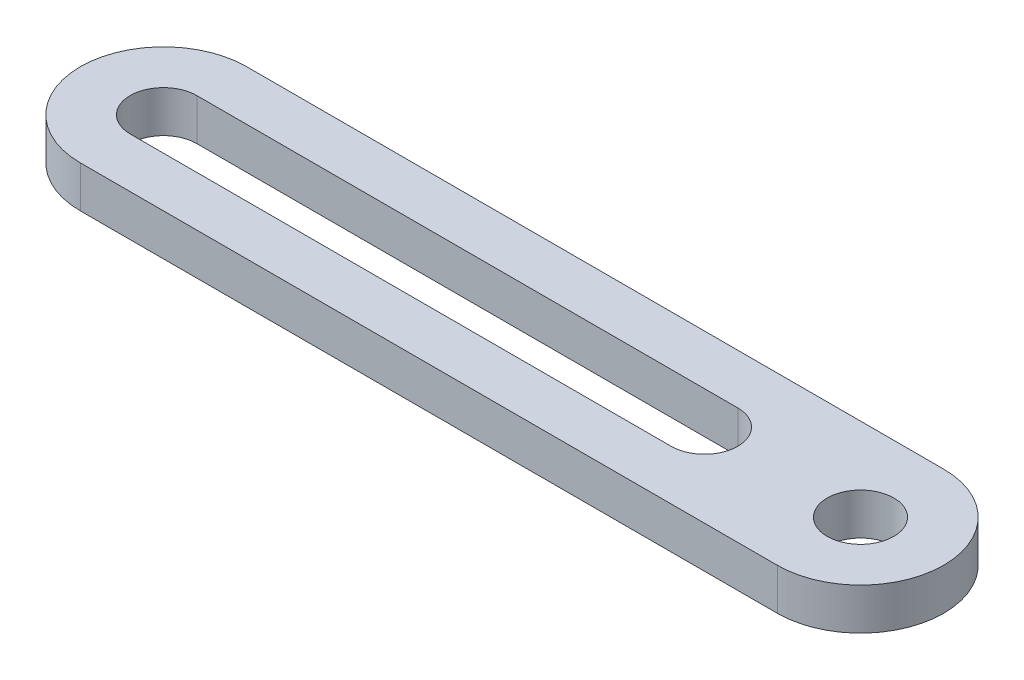
ISO-10303-21;
HEADER;
FILE_DESCRIPTION(('STEP AP214'),'2;1');
FILE_NAME('part.step','',(''),(''),'','','');
FILE_SCHEMA(('AUTOMOTIVE_DESIGN { 1 0 10303 214 1 1 1 1 }'));
ENDSEC;
DATA;
#1=APPLICATION_CONTEXT('core data for automotive mechanical design processes');
#2=APPLICATION_PROTOCOL_DEFINITION('international standard','automotive_design',2000,#1);
#3=PRODUCT_CONTEXT('',#1,'mechanical');
#4=PRODUCT('Part','Part','',(#3));
#5=PRODUCT_RELATED_PRODUCT_CATEGORY('part','',(#4));
#6=PRODUCT_DEFINITION_FORMATION('','',#4);
#7=PRODUCT_DEFINITION_CONTEXT('part definition',#1,'design');
#8=PRODUCT_DEFINITION('design','',#6,#7);
#9=PRODUCT_DEFINITION_SHAPE('','',#8);
#10=(LENGTH_UNIT() NAMED_UNIT(*) SI_UNIT(.MILLI.,.METRE.));
#11=(NAMED_UNIT(*) PLANE_ANGLE_UNIT() SI_UNIT($,.RADIAN.));
#12=(NAMED_UNIT(*) SI_UNIT($,.STERADIAN.) SOLID_ANGLE_UNIT());
#13=UNCERTAINTY_MEASURE_WITH_UNIT(LENGTH_MEASURE(1.E-05),#10,'distance_accuracy_value','');
#14=(GEOMETRIC_REPRESENTATION_CONTEXT(3) GLOBAL_UNCERTAINTY_ASSIGNED_CONTEXT((#13)) GLOBAL_UNIT_ASSIGNED_CONTEXT((#10,
#11,#12)) REPRESENTATION_CONTEXT('',''));
#15=CARTESIAN_POINT('',(0.,0.,0.));
#16=DIRECTION('',(0.,0.,1.));
#17=DIRECTION('',(1.,0.,0.));
#18=AXIS2_PLACEMENT_3D('',#15,#16,#17);
#19=CARTESIAN_POINT('',(0.,2.,0.));
#20=DIRECTION('',(0.,1.,0.));
#21=DIRECTION('',(0.,0.,1.));
#22=AXIS2_PLACEMENT_3D('',#19,#20,#21);
#23=PLANE('',#22);
#24=DIRECTION('',(1.,0.,0.));
#25=VECTOR('',#24,1.);
#26=CARTESIAN_POINT('',(-33.5,2.,1.6));
#27=LINE('',#26,#25);
#28=CARTESIAN_POINT('',(-33.5,2.,1.6));
#29=VERTEX_POINT('',#28);
#30=CARTESIAN_POINT('',(-7.5,2.,1.6));
#31=VERTEX_POINT('',#30);
#32=EDGE_CURVE('E107',#29,#31,#27,.T.);
#33=ORIENTED_EDGE('',*,*,#32,.F.);
#34=CARTESIAN_POINT('',(-33.5,2.,0.));
#35=DIRECTION('',(0.,1.,0.));
#36=DIRECTION('',(0.,0.,1.));
#37=AXIS2_PLACEMENT_3D('',#34,#35,#36);
#38=CIRCLE('',#37,1.6);
#39=CARTESIAN_POINT('',(-33.5,2.,-1.6));
#40=VERTEX_POINT('',#39);
#41=EDGE_CURVE('E99',#40,#29,#38,.T.);
#42=ORIENTED_EDGE('',*,*,#41,.F.);
#43=DIRECTION('',(-1.,0.,0.));
#44=VECTOR('',#43,1.);
#45=CARTESIAN_POINT('',(-33.5,2.,-1.6));
#46=LINE('',#45,#44);
#47=CARTESIAN_POINT('',(-7.5,2.,-1.6));
#48=VERTEX_POINT('',#47);
#49=EDGE_CURVE('E122',#48,#40,#46,.T.);
#50=ORIENTED_EDGE('',*,*,#49,.F.);
#51=CARTESIAN_POINT('',(-7.5,2.,0.));
#52=DIRECTION('',(0.,1.,0.));
#53=DIRECTION('',(0.,0.,1.));
#54=AXIS2_PLACEMENT_3D('',#51,#52,#53);
#55=CIRCLE('',#54,1.6);
#56=EDGE_CURVE('E120',#31,#48,#55,.T.);
#57=ORIENTED_EDGE('',*,*,#56,.F.);
#58=EDGE_LOOP('',(#33,#42,#50,#57));
#59=FACE_BOUND('',#58,.T.);
#60=CARTESIAN_POINT('',(0.,2.,0.));
#61=DIRECTION('',(0.,1.,0.));
#62=DIRECTION('',(0.,0.,1.));
#63=AXIS2_PLACEMENT_3D('',#60,#61,#62);
#64=CIRCLE('',#63,4.);
#65=CARTESIAN_POINT('',(0.,2.,4.));
#66=VERTEX_POINT('',#65);
#67=CARTESIAN_POINT('',(0.,2.,-4.));
#68=VERTEX_POINT('',#67);
#69=EDGE_CURVE('E138',#66,#68,#64,.T.);
#70=ORIENTED_EDGE('',*,*,#69,.T.);
#71=DIRECTION('',(-1.,0.,0.));
#72=VECTOR('',#71,1.);
#73=CARTESIAN_POINT('',(0.,2.,-4.));
#74=LINE('',#73,#72);
#75=CARTESIAN_POINT('',(-33.5,2.,-3.99999999999999));
#76=VERTEX_POINT('',#75);
#77=EDGE_CURVE('E141',#68,#76,#74,.T.);
#78=ORIENTED_EDGE('',*,*,#77,.T.);
#79=CARTESIAN_POINT('',(-33.5,2.,0.));
#80=DIRECTION('',(0.,1.,0.));
#81=DIRECTION('',(0.,0.,1.));
#82=AXIS2_PLACEMENT_3D('',#79,#80,#81);
#83=CIRCLE('',#82,4.);
#84=CARTESIAN_POINT('',(-33.5,2.,4.));
#85=VERTEX_POINT('',#84);
#86=EDGE_CURVE('E144',#76,#85,#83,.T.);
#87=ORIENTED_EDGE('',*,*,#86,.T.);
#88=DIRECTION('',(1.,0.,0.));
#89=VECTOR('',#88,1.);
#90=CARTESIAN_POINT('',(0.,2.,4.));
#91=LINE('',#90,#89);
#92=EDGE_CURVE('E146',#85,#66,#91,.T.);
#93=ORIENTED_EDGE('',*,*,#92,.T.);
#94=EDGE_LOOP('',(#70,#78,#87,#93));
#95=FACE_BOUND('',#94,.T.);
#96=CARTESIAN_POINT('',(0.,2.,0.));
#97=DIRECTION('',(0.,1.,0.));
#98=DIRECTION('',(0.,0.,1.));
#99=AXIS2_PLACEMENT_3D('',#96,#97,#98);
#100=CIRCLE('',#99,1.6);
#101=CARTESIAN_POINT('',(0.,2.,1.6));
#102=VERTEX_POINT('',#101);
#103=EDGE_CURVE('E128',#102,#102,#100,.T.);
#104=ORIENTED_EDGE('',*,*,#103,.F.);
#105=EDGE_LOOP('',(#104));
#106=FACE_BOUND('',#105,.T.);
#107=ADVANCED_FACE('F34',(#59,#95,#106),#23,.T.);
#108=CARTESIAN_POINT('',(0.,0.,0.));
#109=DIRECTION('',(0.,1.,0.));
#110=DIRECTION('',(0.,0.,1.));
#111=AXIS2_PLACEMENT_3D('',#108,#109,#110);
#112=PLANE('',#111);
#113=CARTESIAN_POINT('',(0.,0.,0.));
#114=DIRECTION('',(0.,1.,0.));
#115=DIRECTION('',(0.,0.,1.));
#116=AXIS2_PLACEMENT_3D('',#113,#114,#115);
#117=CIRCLE('',#116,4.);
#118=CARTESIAN_POINT('',(0.,0.,4.));
#119=VERTEX_POINT('',#118);
#120=CARTESIAN_POINT('',(0.,0.,-4.));
#121=VERTEX_POINT('',#120);
#122=EDGE_CURVE('E115',#119,#121,#117,.T.);
#123=ORIENTED_EDGE('',*,*,#122,.F.);
#124=DIRECTION('',(1.,0.,0.));
#125=VECTOR('',#124,1.);
#126=CARTESIAN_POINT('',(0.,0.,4.));
#127=LINE('',#126,#125);
#128=CARTESIAN_POINT('',(-33.5,0.,4.));
#129=VERTEX_POINT('',#128);
#130=EDGE_CURVE('E142',#129,#119,#127,.T.);
#131=ORIENTED_EDGE('',*,*,#130,.F.);
#132=CARTESIAN_POINT('',(-33.5,0.,0.));
#133=DIRECTION('',(0.,1.,0.));
#134=DIRECTION('',(0.,0.,1.));
#135=AXIS2_PLACEMENT_3D('',#132,#133,#134);
#136=CIRCLE('',#135,4.);
#137=CARTESIAN_POINT('',(-33.5,0.,-3.99999999999999));
#138=VERTEX_POINT('',#137);
#139=EDGE_CURVE('E153',#138,#129,#136,.T.);
#140=ORIENTED_EDGE('',*,*,#139,.F.);
#141=DIRECTION('',(-1.,0.,0.));
#142=VECTOR('',#141,1.);
#143=CARTESIAN_POINT('',(0.,0.,-4.));
#144=LINE('',#143,#142);
#145=EDGE_CURVE('E151',#121,#138,#144,.T.);
#146=ORIENTED_EDGE('',*,*,#145,.F.);
#147=EDGE_LOOP('',(#123,#131,#140,#146));
#148=FACE_BOUND('',#147,.T.);
#149=CARTESIAN_POINT('',(-33.5,0.,0.));
#150=DIRECTION('',(0.,1.,0.));
#151=DIRECTION('',(0.,0.,1.));
#152=AXIS2_PLACEMENT_3D('',#149,#150,#151);
#153=CIRCLE('',#152,1.6);
#154=CARTESIAN_POINT('',(-33.5,0.,-1.6));
#155=VERTEX_POINT('',#154);
#156=CARTESIAN_POINT('',(-33.5,0.,1.6));
#157=VERTEX_POINT('',#156);
#158=EDGE_CURVE('E57',#155,#157,#153,.T.);
#159=ORIENTED_EDGE('',*,*,#158,.T.);
#160=DIRECTION('',(1.,0.,0.));
#161=VECTOR('',#160,1.);
#162=CARTESIAN_POINT('',(-33.5,0.,1.6));
#163=LINE('',#162,#161);
#164=CARTESIAN_POINT('',(-7.5,0.,1.6));
#165=VERTEX_POINT('',#164);
#166=EDGE_CURVE('E114',#157,#165,#163,.T.);
#167=ORIENTED_EDGE('',*,*,#166,.T.);
#168=CARTESIAN_POINT('',(-7.5,0.,0.));
#169=DIRECTION('',(0.,1.,0.));
#170=DIRECTION('',(0.,0.,1.));
#171=AXIS2_PLACEMENT_3D('',#168,#169,#170);
#172=CIRCLE('',#171,1.6);
#173=CARTESIAN_POINT('',(-7.5,0.,-1.6));
#174=VERTEX_POINT('',#173);
#175=EDGE_CURVE('E130',#165,#174,#172,.T.);
#176=ORIENTED_EDGE('',*,*,#175,.T.);
#177=DIRECTION('',(-1.,0.,0.));
#178=VECTOR('',#177,1.);
#179=CARTESIAN_POINT('',(-33.5,0.,-1.6));
#180=LINE('',#179,#178);
#181=EDGE_CURVE('E108',#174,#155,#180,.T.);
#182=ORIENTED_EDGE('',*,*,#181,.T.);
#183=EDGE_LOOP('',(#159,#167,#176,#182));
#184=FACE_BOUND('',#183,.T.);
#185=CARTESIAN_POINT('',(0.,0.,0.));
#186=DIRECTION('',(0.,1.,0.));
#187=DIRECTION('',(0.,0.,1.));
#188=AXIS2_PLACEMENT_3D('',#185,#186,#187);
#189=CIRCLE('',#188,1.6);
#190=CARTESIAN_POINT('',(0.,0.,1.6));
#191=VERTEX_POINT('',#190);
#192=EDGE_CURVE('E224',#191,#191,#189,.T.);
#193=ORIENTED_EDGE('',*,*,#192,.T.);
#194=EDGE_LOOP('',(#193));
#195=FACE_BOUND('',#194,.T.);
#196=ADVANCED_FACE('F171',(#148,#184,#195),#112,.F.);
#197=CARTESIAN_POINT('',(0.,2.,0.));
#198=DIRECTION('',(0.,-1.,0.));
#199=DIRECTION('',(0.,0.,-1.));
#200=AXIS2_PLACEMENT_3D('',#197,#198,#199);
#201=CYLINDRICAL_SURFACE('',#200,4.);
#202=ORIENTED_EDGE('',*,*,#122,.T.);
#203=DIRECTION('',(0.,-1.,0.));
#204=VECTOR('',#203,1.);
#205=CARTESIAN_POINT('',(0.,2.,-4.));
#206=LINE('',#205,#204);
#207=EDGE_CURVE('E11',#68,#121,#206,.T.);
#208=ORIENTED_EDGE('',*,*,#207,.F.);
#209=ORIENTED_EDGE('',*,*,#69,.F.);
#210=DIRECTION('',(0.,-1.,0.));
#211=VECTOR('',#210,1.);
#212=CARTESIAN_POINT('',(0.,2.,4.));
#213=LINE('',#212,#211);
#214=EDGE_CURVE('E148',#66,#119,#213,.T.);
#215=ORIENTED_EDGE('',*,*,#214,.T.);
#216=EDGE_LOOP('',(#202,#208,#209,#215));
#217=FACE_BOUND('',#216,.T.);
#218=ADVANCED_FACE('F36',(#217),#201,.T.);
#219=CARTESIAN_POINT('',(0.,2.,-4.));
#220=DIRECTION('',(0.,0.,1.));
#221=DIRECTION('',(1.,0.,0.));
#222=AXIS2_PLACEMENT_3D('',#219,#220,#221);
#223=PLANE('',#222);
#224=ORIENTED_EDGE('',*,*,#145,.T.);
#225=DIRECTION('',(0.,-1.,0.));
#226=VECTOR('',#225,1.);
#227=CARTESIAN_POINT('',(-33.5,2.,-3.99999999999999));
#228=LINE('',#227,#226);
#229=EDGE_CURVE('E42',#76,#138,#228,.T.);
#230=ORIENTED_EDGE('',*,*,#229,.F.);
#231=ORIENTED_EDGE('',*,*,#77,.F.);
#232=ORIENTED_EDGE('',*,*,#207,.T.);
#233=EDGE_LOOP('',(#224,#230,#231,#232));
#234=FACE_BOUND('',#233,.T.);
#235=ADVANCED_FACE('F181',(#234),#223,.F.);
#236=CARTESIAN_POINT('',(-33.5,2.,0.));
#237=DIRECTION('',(0.,-1.,0.));
#238=DIRECTION('',(0.,0.,-1.));
#239=AXIS2_PLACEMENT_3D('',#236,#237,#238);
#240=CYLINDRICAL_SURFACE('',#239,4.);
#241=ORIENTED_EDGE('',*,*,#139,.T.);
#242=DIRECTION('',(0.,-1.,0.));
#243=VECTOR('',#242,1.);
#244=CARTESIAN_POINT('',(-33.5,2.,4.));
#245=LINE('',#244,#243);
#246=EDGE_CURVE('E158',#85,#129,#245,.T.);
#247=ORIENTED_EDGE('',*,*,#246,.F.);
#248=ORIENTED_EDGE('',*,*,#86,.F.);
#249=ORIENTED_EDGE('',*,*,#229,.T.);
#250=EDGE_LOOP('',(#241,#247,#248,#249));
#251=FACE_BOUND('',#250,.T.);
#252=ADVANCED_FACE('F165',(#251),#240,.T.);
#253=CARTESIAN_POINT('',(0.,2.,4.));
#254=DIRECTION('',(0.,0.,-1.));
#255=DIRECTION('',(-1.,0.,0.));
#256=AXIS2_PLACEMENT_3D('',#253,#254,#255);
#257=PLANE('',#256);
#258=ORIENTED_EDGE('',*,*,#130,.T.);
#259=ORIENTED_EDGE('',*,*,#214,.F.);
#260=ORIENTED_EDGE('',*,*,#92,.F.);
#261=ORIENTED_EDGE('',*,*,#246,.T.);
#262=EDGE_LOOP('',(#258,#259,#260,#261));
#263=FACE_BOUND('',#262,.T.);
#264=ADVANCED_FACE('F175',(#263),#257,.F.);
#265=CARTESIAN_POINT('',(-33.5,2.,0.));
#266=DIRECTION('',(0.,-1.,0.));
#267=DIRECTION('',(0.,0.,-1.));
#268=AXIS2_PLACEMENT_3D('',#265,#266,#267);
#269=CYLINDRICAL_SURFACE('',#268,1.6);
#270=ORIENTED_EDGE('',*,*,#158,.F.);
#271=DIRECTION('',(0.,-1.,0.));
#272=VECTOR('',#271,1.);
#273=CARTESIAN_POINT('',(-33.5,2.,-1.6));
#274=LINE('',#273,#272);
#275=EDGE_CURVE('E103',#40,#155,#274,.T.);
#276=ORIENTED_EDGE('',*,*,#275,.F.);
#277=ORIENTED_EDGE('',*,*,#41,.T.);
#278=DIRECTION('',(0.,-1.,0.));
#279=VECTOR('',#278,1.);
#280=CARTESIAN_POINT('',(-33.5,2.,1.6));
#281=LINE('',#280,#279);
#282=EDGE_CURVE('E102',#29,#157,#281,.T.);
#283=ORIENTED_EDGE('',*,*,#282,.T.);
#284=EDGE_LOOP('',(#270,#276,#277,#283));
#285=FACE_BOUND('',#284,.T.);
#286=ADVANCED_FACE('F101',(#285),#269,.F.);
#287=CARTESIAN_POINT('',(-33.5,2.,1.6));
#288=DIRECTION('',(0.,0.,-1.));
#289=DIRECTION('',(-1.,0.,0.));
#290=AXIS2_PLACEMENT_3D('',#287,#288,#289);
#291=PLANE('',#290);
#292=ORIENTED_EDGE('',*,*,#166,.F.);
#293=ORIENTED_EDGE('',*,*,#282,.F.);
#294=ORIENTED_EDGE('',*,*,#32,.T.);
#295=DIRECTION('',(0.,-1.,0.));
#296=VECTOR('',#295,1.);
#297=CARTESIAN_POINT('',(-7.5,2.,1.6));
#298=LINE('',#297,#296);
#299=EDGE_CURVE('E116',#31,#165,#298,.T.);
#300=ORIENTED_EDGE('',*,*,#299,.T.);
#301=EDGE_LOOP('',(#292,#293,#294,#300));
#302=FACE_BOUND('',#301,.T.);
#303=ADVANCED_FACE('F111',(#302),#291,.T.);
#304=CARTESIAN_POINT('',(-7.5,2.,0.));
#305=DIRECTION('',(0.,-1.,0.));
#306=DIRECTION('',(0.,0.,-1.));
#307=AXIS2_PLACEMENT_3D('',#304,#305,#306);
#308=CYLINDRICAL_SURFACE('',#307,1.6);
#309=ORIENTED_EDGE('',*,*,#175,.F.);
#310=ORIENTED_EDGE('',*,*,#299,.F.);
#311=ORIENTED_EDGE('',*,*,#56,.T.);
#312=DIRECTION('',(0.,-1.,0.));
#313=VECTOR('',#312,1.);
#314=CARTESIAN_POINT('',(-7.5,2.,-1.6));
#315=LINE('',#314,#313);
#316=EDGE_CURVE('E49',#48,#174,#315,.T.);
#317=ORIENTED_EDGE('',*,*,#316,.T.);
#318=EDGE_LOOP('',(#309,#310,#311,#317));
#319=FACE_BOUND('',#318,.T.);
#320=ADVANCED_FACE('F204',(#319),#308,.F.);
#321=CARTESIAN_POINT('',(-33.5,2.,-1.6));
#322=DIRECTION('',(0.,0.,1.));
#323=DIRECTION('',(1.,0.,0.));
#324=AXIS2_PLACEMENT_3D('',#321,#322,#323);
#325=PLANE('',#324);
#326=ORIENTED_EDGE('',*,*,#181,.F.);
#327=ORIENTED_EDGE('',*,*,#316,.F.);
#328=ORIENTED_EDGE('',*,*,#49,.T.);
#329=ORIENTED_EDGE('',*,*,#275,.T.);
#330=EDGE_LOOP('',(#326,#327,#328,#329));
#331=FACE_BOUND('',#330,.T.);
#332=ADVANCED_FACE('F208',(#331),#325,.T.);
#333=CARTESIAN_POINT('',(0.,2.,0.));
#334=DIRECTION('',(0.,-1.,0.));
#335=DIRECTION('',(0.,0.,-1.));
#336=AXIS2_PLACEMENT_3D('',#333,#334,#335);
#337=CYLINDRICAL_SURFACE('',#336,1.6);
#338=ORIENTED_EDGE('',*,*,#103,.T.);
#339=EDGE_LOOP('',(#338));
#340=FACE_BOUND('',#339,.T.);
#341=ORIENTED_EDGE('',*,*,#192,.F.);
#342=EDGE_LOOP('',(#341));
#343=FACE_BOUND('',#342,.T.);
#344=ADVANCED_FACE('F214',(#340,#343),#337,.F.);
#345=CLOSED_SHELL('',(#107,#196,#218,#235,#252,#264,#286,#303,#320,#332,#344));
#346=MANIFOLD_SOLID_BREP('B2',#345);
#347=ADVANCED_BREP_SHAPE_REPRESENTATION('',(#18,#346),#14);
#348=SHAPE_DEFINITION_REPRESENTATION(#9,#347);
ENDSEC;
END-ISO-10303-21;
